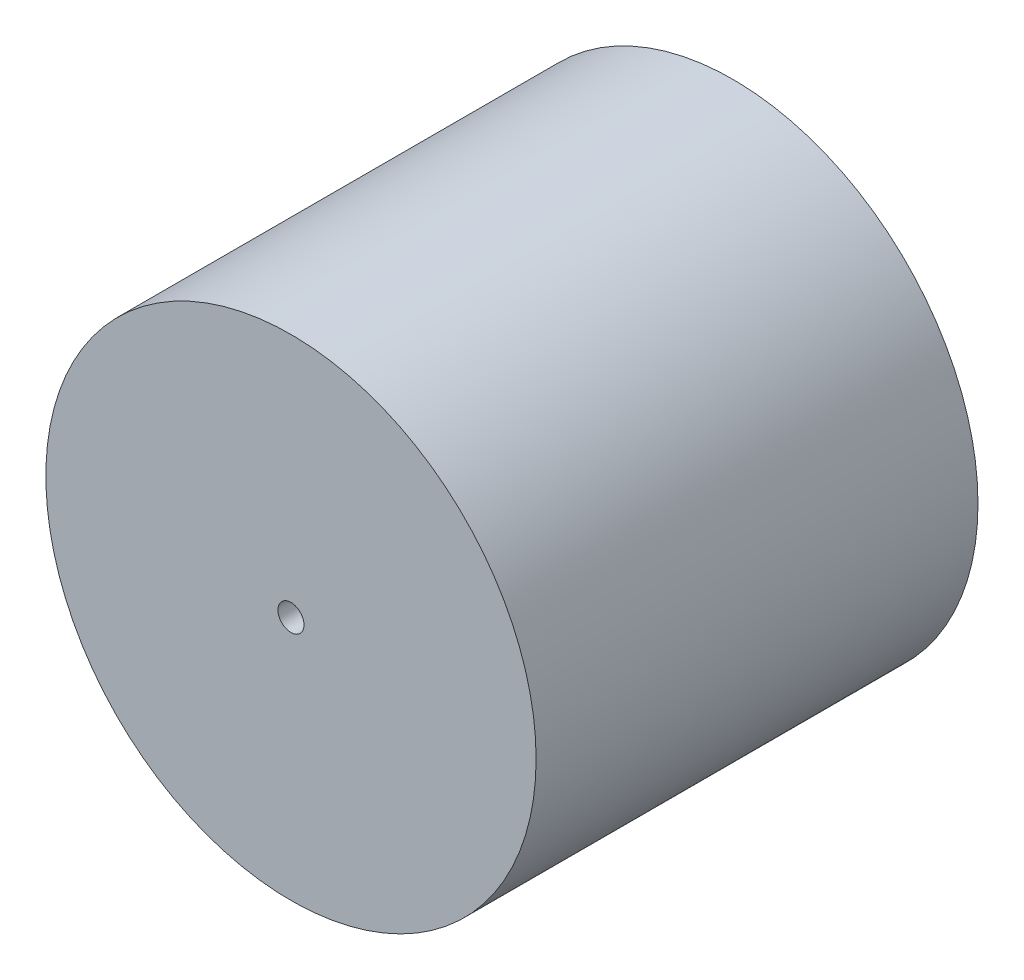
ISO-10303-21;
HEADER;
FILE_DESCRIPTION(('STEP AP214'),'2;1');
FILE_NAME('part.step','',(''),(''),'','','');
FILE_SCHEMA(('AUTOMOTIVE_DESIGN { 1 0 10303 214 1 1 1 1 }'));
ENDSEC;
DATA;
#1=APPLICATION_CONTEXT('core data for automotive mechanical design processes');
#2=APPLICATION_PROTOCOL_DEFINITION('international standard','automotive_design',2000,#1);
#3=PRODUCT_CONTEXT('',#1,'mechanical');
#4=PRODUCT('Part','Part','',(#3));
#5=PRODUCT_RELATED_PRODUCT_CATEGORY('part','',(#4));
#6=PRODUCT_DEFINITION_FORMATION('','',#4);
#7=PRODUCT_DEFINITION_CONTEXT('part definition',#1,'design');
#8=PRODUCT_DEFINITION('design','',#6,#7);
#9=PRODUCT_DEFINITION_SHAPE('','',#8);
#10=(LENGTH_UNIT() NAMED_UNIT(*) SI_UNIT(.MILLI.,.METRE.));
#11=(NAMED_UNIT(*) PLANE_ANGLE_UNIT() SI_UNIT($,.RADIAN.));
#12=(NAMED_UNIT(*) SI_UNIT($,.STERADIAN.) SOLID_ANGLE_UNIT());
#13=UNCERTAINTY_MEASURE_WITH_UNIT(LENGTH_MEASURE(1.E-05),#10,'distance_accuracy_value','');
#14=(GEOMETRIC_REPRESENTATION_CONTEXT(3) GLOBAL_UNCERTAINTY_ASSIGNED_CONTEXT((#13)) GLOBAL_UNIT_ASSIGNED_CONTEXT((#10,
#11,#12)) REPRESENTATION_CONTEXT('',''));
#15=CARTESIAN_POINT('',(0.,0.,0.));
#16=DIRECTION('',(0.,0.,1.));
#17=DIRECTION('',(1.,0.,0.));
#18=AXIS2_PLACEMENT_3D('',#15,#16,#17);
#19=CARTESIAN_POINT('',(0.,0.,68.5));
#20=DIRECTION('',(0.,0.,-1.));
#21=DIRECTION('',(-1.,0.,0.));
#22=AXIS2_PLACEMENT_3D('',#19,#20,#21);
#23=CYLINDRICAL_SURFACE('',#22,38.);
#24=CARTESIAN_POINT('',(0.,0.,68.5));
#25=DIRECTION('',(0.,0.,1.));
#26=DIRECTION('',(1.,0.,0.));
#27=AXIS2_PLACEMENT_3D('',#24,#25,#26);
#28=CIRCLE('',#27,38.);
#29=CARTESIAN_POINT('',(38.,0.,68.5));
#30=VERTEX_POINT('',#29);
#31=EDGE_CURVE('E98',#30,#30,#28,.T.);
#32=ORIENTED_EDGE('',*,*,#31,.F.);
#33=EDGE_LOOP('',(#32));
#34=FACE_BOUND('',#33,.T.);
#35=CARTESIAN_POINT('',(0.,0.,0.));
#36=DIRECTION('',(0.,0.,1.));
#37=DIRECTION('',(1.,0.,0.));
#38=AXIS2_PLACEMENT_3D('',#35,#36,#37);
#39=CIRCLE('',#38,38.);
#40=CARTESIAN_POINT('',(38.,0.,0.));
#41=VERTEX_POINT('',#40);
#42=EDGE_CURVE('E94',#41,#41,#39,.T.);
#43=ORIENTED_EDGE('',*,*,#42,.T.);
#44=EDGE_LOOP('',(#43));
#45=FACE_BOUND('',#44,.T.);
#46=ADVANCED_FACE('F48',(#34,#45),#23,.T.);
#47=CARTESIAN_POINT('',(0.,0.,68.5));
#48=DIRECTION('',(0.,0.,1.));
#49=DIRECTION('',(1.,0.,0.));
#50=AXIS2_PLACEMENT_3D('',#47,#48,#49);
#51=PLANE('',#50);
#52=CARTESIAN_POINT('',(0.,0.,68.5));
#53=DIRECTION('',(0.,0.,1.));
#54=DIRECTION('',(1.,0.,0.));
#55=AXIS2_PLACEMENT_3D('',#52,#53,#54);
#56=CIRCLE('',#55,2.01929999999999);
#57=CARTESIAN_POINT('',(2.01929999999999,0.,68.5));
#58=VERTEX_POINT('',#57);
#59=EDGE_CURVE('E75',#58,#58,#56,.T.);
#60=ORIENTED_EDGE('',*,*,#59,.F.);
#61=EDGE_LOOP('',(#60));
#62=FACE_BOUND('',#61,.T.);
#63=ORIENTED_EDGE('',*,*,#31,.T.);
#64=EDGE_LOOP('',(#63));
#65=FACE_BOUND('',#64,.T.);
#66=ADVANCED_FACE('F128',(#62,#65),#51,.T.);
#67=CARTESIAN_POINT('',(0.,0.,0.));
#68=DIRECTION('',(0.,0.,1.));
#69=DIRECTION('',(1.,0.,0.));
#70=AXIS2_PLACEMENT_3D('',#67,#68,#69);
#71=PLANE('',#70);
#72=CARTESIAN_POINT('',(0.,0.,0.));
#73=DIRECTION('',(0.,0.,-1.));
#74=DIRECTION('',(-1.,0.,0.));
#75=AXIS2_PLACEMENT_3D('',#72,#73,#74);
#76=CIRCLE('',#75,20.5);
#77=CARTESIAN_POINT('',(-20.5,0.,0.));
#78=VERTEX_POINT('',#77);
#79=EDGE_CURVE('E89',#78,#78,#76,.T.);
#80=ORIENTED_EDGE('',*,*,#79,.F.);
#81=EDGE_LOOP('',(#80));
#82=FACE_BOUND('',#81,.T.);
#83=ORIENTED_EDGE('',*,*,#42,.F.);
#84=EDGE_LOOP('',(#83));
#85=FACE_BOUND('',#84,.T.);
#86=ADVANCED_FACE('F133',(#82,#85),#71,.F.);
#87=CARTESIAN_POINT('',(0.,0.,2.));
#88=DIRECTION('',(0.,0.,-1.));
#89=DIRECTION('',(-1.,0.,0.));
#90=AXIS2_PLACEMENT_3D('',#87,#88,#89);
#91=CYLINDRICAL_SURFACE('',#90,20.5);
#92=CARTESIAN_POINT('',(0.,0.,2.));
#93=DIRECTION('',(0.,0.,-1.));
#94=DIRECTION('',(-1.,0.,0.));
#95=AXIS2_PLACEMENT_3D('',#92,#93,#94);
#96=CIRCLE('',#95,20.5);
#97=CARTESIAN_POINT('',(-20.5,0.,2.));
#98=VERTEX_POINT('',#97);
#99=EDGE_CURVE('E90',#98,#98,#96,.T.);
#100=ORIENTED_EDGE('',*,*,#99,.F.);
#101=EDGE_LOOP('',(#100));
#102=FACE_BOUND('',#101,.T.);
#103=ORIENTED_EDGE('',*,*,#79,.T.);
#104=EDGE_LOOP('',(#103));
#105=FACE_BOUND('',#104,.T.);
#106=ADVANCED_FACE('F140',(#102,#105),#91,.F.);
#107=CARTESIAN_POINT('',(0.,0.,2.));
#108=DIRECTION('',(0.,0.,-1.));
#109=DIRECTION('',(-1.,0.,0.));
#110=AXIS2_PLACEMENT_3D('',#107,#108,#109);
#111=PLANE('',#110);
#112=CARTESIAN_POINT('',(0.,0.,2.));
#113=DIRECTION('',(0.,0.,-1.));
#114=DIRECTION('',(-1.,0.,0.));
#115=AXIS2_PLACEMENT_3D('',#112,#113,#114);
#116=CIRCLE('',#115,11.);
#117=CARTESIAN_POINT('',(-11.,0.,2.));
#118=VERTEX_POINT('',#117);
#119=EDGE_CURVE('E102',#118,#118,#116,.T.);
#120=ORIENTED_EDGE('',*,*,#119,.F.);
#121=EDGE_LOOP('',(#120));
#122=FACE_BOUND('',#121,.T.);
#123=ORIENTED_EDGE('',*,*,#99,.T.);
#124=EDGE_LOOP('',(#123));
#125=FACE_BOUND('',#124,.T.);
#126=ADVANCED_FACE('F145',(#122,#125),#111,.T.);
#127=CARTESIAN_POINT('',(0.,0.,-4.35));
#128=DIRECTION('',(0.,0.,1.));
#129=DIRECTION('',(1.,0.,0.));
#130=AXIS2_PLACEMENT_3D('',#127,#128,#129);
#131=CYLINDRICAL_SURFACE('',#130,11.);
#132=CARTESIAN_POINT('',(0.,0.,0.));
#133=DIRECTION('',(0.,0.,1.));
#134=DIRECTION('',(1.,0.,0.));
#135=AXIS2_PLACEMENT_3D('',#132,#133,#134);
#136=CIRCLE('',#135,11.);
#137=CARTESIAN_POINT('',(11.,0.,0.));
#138=VERTEX_POINT('',#137);
#139=EDGE_CURVE('E58',#138,#138,#136,.T.);
#140=ORIENTED_EDGE('',*,*,#139,.T.);
#141=EDGE_LOOP('',(#140));
#142=FACE_BOUND('',#141,.T.);
#143=ORIENTED_EDGE('',*,*,#119,.T.);
#144=EDGE_LOOP('',(#143));
#145=FACE_BOUND('',#144,.T.);
#146=ADVANCED_FACE('F112',(#142,#145),#131,.T.);
#147=CARTESIAN_POINT('',(0.,0.,-4.35));
#148=DIRECTION('',(0.,0.,1.));
#149=DIRECTION('',(1.,0.,0.));
#150=AXIS2_PLACEMENT_3D('',#147,#148,#149);
#151=PLANE('',#150);
#152=CARTESIAN_POINT('',(0.,0.,-4.35));
#153=DIRECTION('',(0.,0.,-1.));
#154=DIRECTION('',(-1.,0.,0.));
#155=AXIS2_PLACEMENT_3D('',#152,#153,#154);
#156=CIRCLE('',#155,2.01929999999999);
#157=CARTESIAN_POINT('',(-2.01929999999999,0.,-4.35));
#158=VERTEX_POINT('',#157);
#159=EDGE_CURVE('E76',#158,#158,#156,.T.);
#160=ORIENTED_EDGE('',*,*,#159,.F.);
#161=EDGE_LOOP('',(#160));
#162=FACE_BOUND('',#161,.T.);
#163=CARTESIAN_POINT('',(0.,0.,-4.35));
#164=DIRECTION('',(0.,0.,1.));
#165=DIRECTION('',(1.,0.,0.));
#166=AXIS2_PLACEMENT_3D('',#163,#164,#165);
#167=CIRCLE('',#166,7.08324240730439);
#168=CARTESIAN_POINT('',(7.08324240730439,0.,-4.35));
#169=VERTEX_POINT('',#168);
#170=EDGE_CURVE('E11',#169,#169,#167,.F.);
#171=ORIENTED_EDGE('',*,*,#170,.T.);
#172=EDGE_LOOP('',(#171));
#173=FACE_BOUND('',#172,.T.);
#174=ADVANCED_FACE('F117',(#162,#173),#151,.F.);
#175=CARTESIAN_POINT('',(0.,0.,0.));
#176=DIRECTION('',(0.,0.,1.));
#177=DIRECTION('',(1.,0.,0.));
#178=AXIS2_PLACEMENT_3D('',#175,#176,#177);
#179=CONICAL_SURFACE('',#178,11.,0.733038285837614);
#180=ORIENTED_EDGE('',*,*,#170,.F.);
#181=EDGE_LOOP('',(#180));
#182=FACE_BOUND('',#181,.T.);
#183=ORIENTED_EDGE('',*,*,#139,.F.);
#184=EDGE_LOOP('',(#183));
#185=FACE_BOUND('',#184,.T.);
#186=ADVANCED_FACE('F51',(#182,#185),#179,.T.);
#187=CARTESIAN_POINT('',(0.,0.,62.9));
#188=DIRECTION('',(0.,0.,1.));
#189=DIRECTION('',(1.,0.,0.));
#190=AXIS2_PLACEMENT_3D('',#187,#188,#189);
#191=CONICAL_SURFACE('',#190,2.01929999999999,1.02974425867665);
#192=CARTESIAN_POINT('',(0.,0.,61.6866821519977));
#193=VERTEX_POINT('',#192);
#194=VERTEX_LOOP('',#193);
#195=FACE_BOUND('',#194,.T.);
#196=CARTESIAN_POINT('',(0.,0.,62.9));
#197=DIRECTION('',(0.,0.,1.));
#198=DIRECTION('',(1.,0.,0.));
#199=AXIS2_PLACEMENT_3D('',#196,#197,#198);
#200=CIRCLE('',#199,2.01929999999999);
#201=CARTESIAN_POINT('',(2.01929999999999,0.,62.9));
#202=VERTEX_POINT('',#201);
#203=EDGE_CURVE('E81',#202,#202,#200,.T.);
#204=ORIENTED_EDGE('',*,*,#203,.T.);
#205=EDGE_LOOP('',(#204));
#206=FACE_BOUND('',#205,.T.);
#207=ADVANCED_FACE('F116',(#195,#206),#191,.F.);
#208=CARTESIAN_POINT('',(0.,0.,68.5));
#209=DIRECTION('',(0.,0.,1.));
#210=DIRECTION('',(1.,0.,0.));
#211=AXIS2_PLACEMENT_3D('',#208,#209,#210);
#212=CYLINDRICAL_SURFACE('',#211,2.01929999999999);
#213=ORIENTED_EDGE('',*,*,#203,.F.);
#214=EDGE_LOOP('',(#213));
#215=FACE_BOUND('',#214,.T.);
#216=ORIENTED_EDGE('',*,*,#59,.T.);
#217=EDGE_LOOP('',(#216));
#218=FACE_BOUND('',#217,.T.);
#219=ADVANCED_FACE('F68',(#215,#218),#212,.F.);
#220=CARTESIAN_POINT('',(0.,0.,8.65));
#221=DIRECTION('',(0.,0.,-1.));
#222=DIRECTION('',(-1.,0.,0.));
#223=AXIS2_PLACEMENT_3D('',#220,#221,#222);
#224=CONICAL_SURFACE('',#223,2.0193,1.02974425867665);
#225=CARTESIAN_POINT('',(0.,0.,9.86331784800235));
#226=VERTEX_POINT('',#225);
#227=VERTEX_LOOP('',#226);
#228=FACE_BOUND('',#227,.T.);
#229=CARTESIAN_POINT('',(0.,0.,8.65));
#230=DIRECTION('',(0.,0.,-1.));
#231=DIRECTION('',(-1.,0.,0.));
#232=AXIS2_PLACEMENT_3D('',#229,#230,#231);
#233=CIRCLE('',#232,2.0193);
#234=CARTESIAN_POINT('',(-2.0193,0.,8.65));
#235=VERTEX_POINT('',#234);
#236=EDGE_CURVE('E72',#235,#235,#233,.T.);
#237=ORIENTED_EDGE('',*,*,#236,.T.);
#238=EDGE_LOOP('',(#237));
#239=FACE_BOUND('',#238,.T.);
#240=ADVANCED_FACE('F64',(#228,#239),#224,.F.);
#241=CARTESIAN_POINT('',(0.,0.,-4.35));
#242=DIRECTION('',(0.,0.,-1.));
#243=DIRECTION('',(-1.,0.,0.));
#244=AXIS2_PLACEMENT_3D('',#241,#242,#243);
#245=CYLINDRICAL_SURFACE('',#244,2.01929999999999);
#246=ORIENTED_EDGE('',*,*,#236,.F.);
#247=EDGE_LOOP('',(#246));
#248=FACE_BOUND('',#247,.T.);
#249=ORIENTED_EDGE('',*,*,#159,.T.);
#250=EDGE_LOOP('',(#249));
#251=FACE_BOUND('',#250,.T.);
#252=ADVANCED_FACE('F67',(#248,#251),#245,.F.);
#253=CLOSED_SHELL('',(#46,#66,#86,#106,#126,#146,#174,#186,#207,#219,#240,#252));
#254=MANIFOLD_SOLID_BREP('B2',#253);
#255=ADVANCED_BREP_SHAPE_REPRESENTATION('',(#18,#254),#14);
#256=SHAPE_DEFINITION_REPRESENTATION(#9,#255);
ENDSEC;
END-ISO-10303-21;
